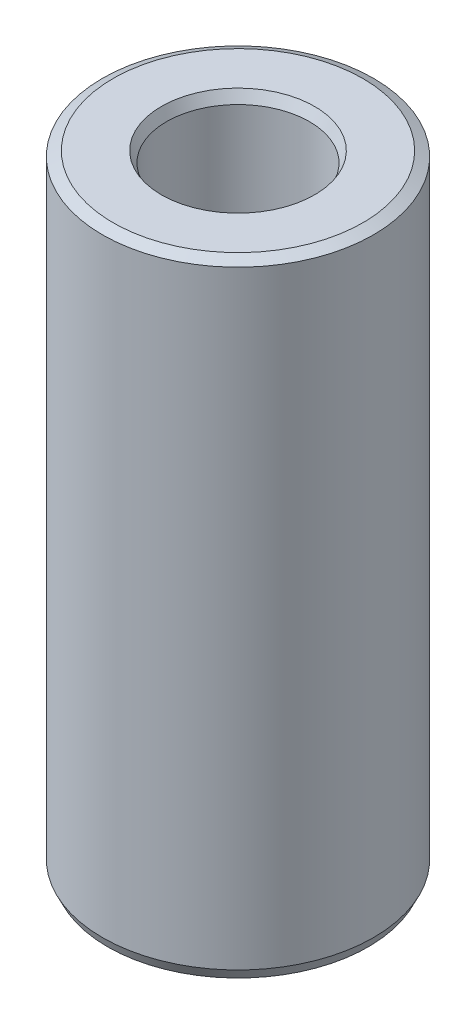
ISO-10303-21;
HEADER;
FILE_DESCRIPTION(('STEP AP214'),'2;1');
FILE_NAME('part.step','',(''),(''),'','','');
FILE_SCHEMA(('AUTOMOTIVE_DESIGN { 1 0 10303 214 1 1 1 1 }'));
ENDSEC;
DATA;
#1=APPLICATION_CONTEXT('core data for automotive mechanical design processes');
#2=APPLICATION_PROTOCOL_DEFINITION('international standard','automotive_design',2000,#1);
#3=PRODUCT_CONTEXT('',#1,'mechanical');
#4=PRODUCT('Part','Part','',(#3));
#5=PRODUCT_RELATED_PRODUCT_CATEGORY('part','',(#4));
#6=PRODUCT_DEFINITION_FORMATION('','',#4);
#7=PRODUCT_DEFINITION_CONTEXT('part definition',#1,'design');
#8=PRODUCT_DEFINITION('design','',#6,#7);
#9=PRODUCT_DEFINITION_SHAPE('','',#8);
#10=(LENGTH_UNIT() NAMED_UNIT(*) SI_UNIT(.MILLI.,.METRE.));
#11=(NAMED_UNIT(*) PLANE_ANGLE_UNIT() SI_UNIT($,.RADIAN.));
#12=(NAMED_UNIT(*) SI_UNIT($,.STERADIAN.) SOLID_ANGLE_UNIT());
#13=UNCERTAINTY_MEASURE_WITH_UNIT(LENGTH_MEASURE(1.E-05),#10,'distance_accuracy_value','');
#14=(GEOMETRIC_REPRESENTATION_CONTEXT(3) GLOBAL_UNCERTAINTY_ASSIGNED_CONTEXT((#13)) GLOBAL_UNIT_ASSIGNED_CONTEXT((#10,
#11,#12)) REPRESENTATION_CONTEXT('',''));
#15=CARTESIAN_POINT('',(0.,0.,0.));
#16=DIRECTION('',(0.,0.,1.));
#17=DIRECTION('',(1.,0.,0.));
#18=AXIS2_PLACEMENT_3D('',#15,#16,#17);
#19=CARTESIAN_POINT('',(0.,230.315111073025,0.));
#20=DIRECTION('',(0.,-1.,0.));
#21=DIRECTION('',(0.,0.,-1.));
#22=AXIS2_PLACEMENT_3D('',#19,#20,#21);
#23=CYLINDRICAL_SURFACE('',#22,50.);
#24=CARTESIAN_POINT('',(0.,3.91410527196218,0.));
#25=DIRECTION('',(0.,1.,0.));
#26=DIRECTION('',(0.,0.,1.));
#27=AXIS2_PLACEMENT_3D('',#24,#25,#26);
#28=CIRCLE('',#27,50.);
#29=CARTESIAN_POINT('',(0.,3.91410527196218,50.));
#30=VERTEX_POINT('',#29);
#31=EDGE_CURVE('E10',#30,#30,#28,.T.);
#32=ORIENTED_EDGE('',*,*,#31,.T.);
#33=EDGE_LOOP('',(#32));
#34=FACE_BOUND('',#33,.T.);
#35=CARTESIAN_POINT('',(0.,228.420016169975,0.));
#36=DIRECTION('',(0.,1.,0.));
#37=DIRECTION('',(0.,0.,1.));
#38=AXIS2_PLACEMENT_3D('',#35,#36,#37);
#39=CIRCLE('',#38,50.);
#40=CARTESIAN_POINT('',(0.,228.420016169975,-50.));
#41=VERTEX_POINT('',#40);
#42=EDGE_CURVE('E50',#41,#41,#39,.F.);
#43=ORIENTED_EDGE('',*,*,#42,.T.);
#44=EDGE_LOOP('',(#43));
#45=FACE_BOUND('',#44,.T.);
#46=ADVANCED_FACE('F39',(#34,#45),#23,.T.);
#47=CARTESIAN_POINT('',(0.,230.315111073025,0.));
#48=DIRECTION('',(0.,1.,0.));
#49=DIRECTION('',(0.,0.,1.));
#50=AXIS2_PLACEMENT_3D('',#47,#48,#49);
#51=PLANE('',#50);
#52=CARTESIAN_POINT('',(0.,230.315111073025,0.));
#53=DIRECTION('',(0.,1.,0.));
#54=DIRECTION('',(0.,0.,1.));
#55=AXIS2_PLACEMENT_3D('',#52,#53,#54);
#56=CIRCLE('',#55,28.2652604303224);
#57=CARTESIAN_POINT('',(0.,230.315111073025,28.2652604303224));
#58=VERTEX_POINT('',#57);
#59=EDGE_CURVE('E58',#58,#58,#56,.F.);
#60=ORIENTED_EDGE('',*,*,#59,.T.);
#61=EDGE_LOOP('',(#60));
#62=FACE_BOUND('',#61,.T.);
#63=CARTESIAN_POINT('',(0.,230.315111073025,0.));
#64=DIRECTION('',(0.,1.,0.));
#65=DIRECTION('',(0.,0.,1.));
#66=AXIS2_PLACEMENT_3D('',#63,#64,#65);
#67=CIRCLE('',#66,46.0858947280378);
#68=CARTESIAN_POINT('',(0.,230.315111073025,-46.0858947280378));
#69=VERTEX_POINT('',#68);
#70=EDGE_CURVE('E61',#69,#69,#67,.T.);
#71=ORIENTED_EDGE('',*,*,#70,.T.);
#72=EDGE_LOOP('',(#71));
#73=FACE_BOUND('',#72,.T.);
#74=ADVANCED_FACE('F88',(#62,#73),#51,.T.);
#75=CARTESIAN_POINT('',(0.,0.,0.));
#76=DIRECTION('',(0.,1.,0.));
#77=DIRECTION('',(0.,0.,1.));
#78=AXIS2_PLACEMENT_3D('',#75,#76,#77);
#79=PLANE('',#78);
#80=CARTESIAN_POINT('',(0.,0.,0.));
#81=DIRECTION('',(0.,1.,0.));
#82=DIRECTION('',(0.,0.,1.));
#83=AXIS2_PLACEMENT_3D('',#80,#81,#82);
#84=CIRCLE('',#83,30.2842707992345);
#85=CARTESIAN_POINT('',(0.,0.,-30.2842707992345));
#86=VERTEX_POINT('',#85);
#87=EDGE_CURVE('E51',#86,#86,#84,.T.);
#88=ORIENTED_EDGE('',*,*,#87,.T.);
#89=EDGE_LOOP('',(#88));
#90=FACE_BOUND('',#89,.T.);
#91=CARTESIAN_POINT('',(0.,0.,0.));
#92=DIRECTION('',(0.,1.,0.));
#93=DIRECTION('',(0.,0.,1.));
#94=AXIS2_PLACEMENT_3D('',#91,#92,#93);
#95=CIRCLE('',#94,48.1049050969498);
#96=CARTESIAN_POINT('',(0.,0.,48.1049050969498));
#97=VERTEX_POINT('',#96);
#98=EDGE_CURVE('E54',#97,#97,#95,.F.);
#99=ORIENTED_EDGE('',*,*,#98,.T.);
#100=EDGE_LOOP('',(#99));
#101=FACE_BOUND('',#100,.T.);
#102=ADVANCED_FACE('F83',(#90,#101),#79,.F.);
#103=CARTESIAN_POINT('',(0.,230.315111073025,0.));
#104=DIRECTION('',(0.,-1.,0.));
#105=DIRECTION('',(0.,0.,-1.));
#106=AXIS2_PLACEMENT_3D('',#103,#104,#105);
#107=CYLINDRICAL_SURFACE('',#106,26.3701655272722);
#108=CARTESIAN_POINT('',(0.,226.401005801063,0.));
#109=DIRECTION('',(0.,1.,0.));
#110=DIRECTION('',(0.,0.,1.));
#111=AXIS2_PLACEMENT_3D('',#108,#109,#110);
#112=CIRCLE('',#111,26.3701655272722);
#113=CARTESIAN_POINT('',(0.,226.401005801063,26.3701655272722));
#114=VERTEX_POINT('',#113);
#115=EDGE_CURVE('E67',#114,#114,#112,.T.);
#116=ORIENTED_EDGE('',*,*,#115,.T.);
#117=EDGE_LOOP('',(#116));
#118=FACE_BOUND('',#117,.T.);
#119=CARTESIAN_POINT('',(0.,1.8950949030502,0.));
#120=DIRECTION('',(0.,1.,0.));
#121=DIRECTION('',(0.,0.,1.));
#122=AXIS2_PLACEMENT_3D('',#119,#120,#121);
#123=CIRCLE('',#122,26.3701655272722);
#124=CARTESIAN_POINT('',(0.,1.8950949030502,-26.3701655272722));
#125=VERTEX_POINT('',#124);
#126=EDGE_CURVE('E69',#125,#125,#123,.F.);
#127=ORIENTED_EDGE('',*,*,#126,.T.);
#128=EDGE_LOOP('',(#127));
#129=FACE_BOUND('',#128,.T.);
#130=ADVANCED_FACE('F71',(#118,#129),#107,.F.);
#131=CARTESIAN_POINT('',(0.,226.401005801063,0.));
#132=DIRECTION('',(0.,1.,0.));
#133=DIRECTION('',(0.,0.,1.));
#134=AXIS2_PLACEMENT_3D('',#131,#132,#133);
#135=CONICAL_SURFACE('',#134,26.3701655272722,0.450904128025095);
#136=ORIENTED_EDGE('',*,*,#59,.F.);
#137=EDGE_LOOP('',(#136));
#138=FACE_BOUND('',#137,.T.);
#139=ORIENTED_EDGE('',*,*,#115,.F.);
#140=EDGE_LOOP('',(#139));
#141=FACE_BOUND('',#140,.T.);
#142=ADVANCED_FACE('F77',(#138,#141),#135,.F.);
#143=CARTESIAN_POINT('',(0.,0.,0.));
#144=DIRECTION('',(0.,-1.,0.));
#145=DIRECTION('',(0.,0.,-1.));
#146=AXIS2_PLACEMENT_3D('',#143,#144,#145);
#147=CONICAL_SURFACE('',#146,30.2842707992345,1.1198921987698);
#148=CARTESIAN_POINT('',(0.,1.8950949030502,-26.3701655272722));
#149=CARTESIAN_POINT('',(0.,1.87535433114343,-26.4109374571885));
#150=CARTESIAN_POINT('',(0.,1.85561375923666,-26.4517093871048));
#151=CARTESIAN_POINT('',(0.,1.81613261542311,-26.5332532469373));
#152=CARTESIAN_POINT('',(0.,1.79639204351634,-26.5740251768536));
#153=CARTESIAN_POINT('',(0.,1.75691089970279,-26.6555690366861));
#154=CARTESIAN_POINT('',(0.,1.73717032779602,-26.6963409666024));
#155=CARTESIAN_POINT('',(0.,1.69768918398247,-26.777884826435));
#156=CARTESIAN_POINT('',(0.,1.6779486120757,-26.8186567563512));
#157=CARTESIAN_POINT('',(0.,1.63846746826216,-26.9002006161838));
#158=CARTESIAN_POINT('',(0.,1.61872689635538,-26.9409725461001));
#159=CARTESIAN_POINT('',(0.,1.57924575254184,-27.0225164059326));
#160=CARTESIAN_POINT('',(0.,1.55950518063506,-27.0632883358489));
#161=CARTESIAN_POINT('',(0.,1.52002403682152,-27.1448321956814));
#162=CARTESIAN_POINT('',(0.,1.50028346491474,-27.1856041255977));
#163=CARTESIAN_POINT('',(0.,1.4608023211012,-27.2671479854302));
#164=CARTESIAN_POINT('',(0.,1.44106174919443,-27.3079199153465));
#165=CARTESIAN_POINT('',(0.,1.40158060538088,-27.3894637751791));
#166=CARTESIAN_POINT('',(0.,1.38184003347411,-27.4302357050953));
#167=CARTESIAN_POINT('',(0.,1.34235888966056,-27.5117795649279));
#168=CARTESIAN_POINT('',(0.,1.32261831775379,-27.5525514948442));
#169=CARTESIAN_POINT('',(0.,1.28313717394024,-27.6340953546767));
#170=CARTESIAN_POINT('',(0.,1.26339660203347,-27.674867284593));
#171=CARTESIAN_POINT('',(0.,1.22391545821992,-27.7564111444255));
#172=CARTESIAN_POINT('',(0.,1.20417488631315,-27.7971830743418));
#173=CARTESIAN_POINT('',(0.,1.1646937424996,-27.8787269341743));
#174=CARTESIAN_POINT('',(0.,1.14495317059283,-27.9194988640906));
#175=CARTESIAN_POINT('',(0.,1.10547202677929,-28.0010427239232));
#176=CARTESIAN_POINT('',(0.,1.08573145487251,-28.0418146538394));
#177=CARTESIAN_POINT('',(0.,1.04625031105897,-28.123358513672));
#178=CARTESIAN_POINT('',(0.,1.02650973915219,-28.1641304435883));
#179=CARTESIAN_POINT('',(0.,0.987028595338648,-28.2456743034208));
#180=CARTESIAN_POINT('',(0.,0.967288023431875,-28.2864462333371));
#181=CARTESIAN_POINT('',(0.,0.927806879618329,-28.3679900931696));
#182=CARTESIAN_POINT('',(0.,0.908066307711556,-28.4087620230859));
#183=CARTESIAN_POINT('',(0.,0.86858516389801,-28.4903058829185));
#184=CARTESIAN_POINT('',(0.,0.848844591991237,-28.5310778128347));
#185=CARTESIAN_POINT('',(0.,0.809363448177691,-28.6126216726673));
#186=CARTESIAN_POINT('',(0.,0.789622876270918,-28.6533936025835));
#187=CARTESIAN_POINT('',(0.,0.750141732457372,-28.7349374624161));
#188=CARTESIAN_POINT('',(0.,0.730401160550599,-28.7757093923324));
#189=CARTESIAN_POINT('',(0.,0.690920016737054,-28.8572532521649));
#190=CARTESIAN_POINT('',(0.,0.671179444830281,-28.8980251820812));
#191=CARTESIAN_POINT('',(0.,0.631698301016734,-28.9795690419137));
#192=CARTESIAN_POINT('',(0.,0.611957729109961,-29.02034097183));
#193=CARTESIAN_POINT('',(0.,0.572476585296416,-29.1018848316626));
#194=CARTESIAN_POINT('',(0.,0.552736013389643,-29.1426567615788));
#195=CARTESIAN_POINT('',(0.,0.513254869576097,-29.2242006214114));
#196=CARTESIAN_POINT('',(0.,0.493514297669324,-29.2649725513276));
#197=CARTESIAN_POINT('',(0.,0.454033153855778,-29.3465164111602));
#198=CARTESIAN_POINT('',(0.,0.434292581949005,-29.3872883410765));
#199=CARTESIAN_POINT('',(0.,0.394811438135459,-29.468832200909));
#200=CARTESIAN_POINT('',(0.,0.375070866228686,-29.5096041308253));
#201=CARTESIAN_POINT('',(0.,0.33558972241514,-29.5911479906578));
#202=CARTESIAN_POINT('',(0.,0.315849150508367,-29.6319199205741));
#203=CARTESIAN_POINT('',(0.,0.276368006694822,-29.7134637804067));
#204=CARTESIAN_POINT('',(0.,0.256627434788049,-29.7542357103229));
#205=CARTESIAN_POINT('',(0.,0.217146290974502,-29.8357795701555));
#206=CARTESIAN_POINT('',(0.,0.19740571906773,-29.8765515000717));
#207=CARTESIAN_POINT('',(0.,0.157924575254184,-29.9580953599043));
#208=CARTESIAN_POINT('',(0.,0.13818400334741,-29.9988672898206));
#209=CARTESIAN_POINT('',(0.,0.0987028595338646,-30.0804111496531));
#210=CARTESIAN_POINT('',(0.,0.0789622876270918,-30.1211830795694));
#211=CARTESIAN_POINT('',(0.,0.0394811438135464,-30.2027269394019));
#212=CARTESIAN_POINT('',(0.,0.0197405719067736,-30.2434988693182));
#213=CARTESIAN_POINT('',(0.,0.,-30.2842707992345));
#214=B_SPLINE_CURVE_WITH_KNOTS('',3,(#148,#149,#150,#151,#152,#153,#154,#155,#156,#157,#158,
#159,#160,#161,#162,#163,#164,#165,#166,#167,#168,#169,#170,#171,#172,#173,#174,#175,#176,#177,
#178,#179,#180,#181,#182,#183,#184,#185,#186,#187,#188,#189,#190,#191,#192,#193,#194,#195,#196,
#197,#198,#199,#200,#201,#202,#203,#204,#205,#206,#207,#208,#209,#210,#211,#212,#213),
.UNSPECIFIED.,.F.,.F.,(4,2,2,2,2,2,2,2,2,2,2,2,2,2,2,2,2,2,2,2,2,2,2,2,2,2,2,2,2,2,2,2,4),(0.,
0.135898359205458,0.27179671841092,0.407695077616378,0.543593436821836,0.679491796027294,
0.815390155232755,0.951288514438214,1.08718687364367,1.22308523284913,1.35898359205459,
1.49488195126005,1.63078031046551,1.76667866967097,1.90257702887643,2.03847538808188,
2.17437374728735,2.3102721064928,2.44617046569826,2.58206882490372,2.71796718410918,
2.85386554331464,2.9897639025201,3.12566226172556,3.26156062093102,3.39745898013647,
3.53335733934193,3.66925569854739,3.80515405775285,3.94105241695831,4.07695077616377,
4.21284913536923,4.34874749457469),.UNSPECIFIED.);
#215=EDGE_CURVE('BSEAM73',#125,#86,#214,.T.);
#216=ORIENTED_EDGE('',*,*,#126,.F.);
#217=ORIENTED_EDGE('',*,*,#87,.F.);
#218=ORIENTED_EDGE('',*,*,#215,.T.);
#219=ORIENTED_EDGE('',*,*,#215,.F.);
#220=EDGE_LOOP('',(#216,#218,#217,#219));
#221=FACE_BOUND('',#220,.T.);
#222=ADVANCED_FACE('F73',(#221),#147,.F.);
#223=CARTESIAN_POINT('',(0.,3.91410527196218,0.));
#224=DIRECTION('',(0.,1.,0.));
#225=DIRECTION('',(0.,0.,1.));
#226=AXIS2_PLACEMENT_3D('',#223,#224,#225);
#227=CONICAL_SURFACE('',#226,50.,0.450904128025099);
#228=ORIENTED_EDGE('',*,*,#98,.F.);
#229=EDGE_LOOP('',(#228));
#230=FACE_BOUND('',#229,.T.);
#231=ORIENTED_EDGE('',*,*,#31,.F.);
#232=EDGE_LOOP('',(#231));
#233=FACE_BOUND('',#232,.T.);
#234=ADVANCED_FACE('F76',(#230,#233),#227,.T.);
#235=CARTESIAN_POINT('',(0.,230.315111073025,0.));
#236=DIRECTION('',(0.,-1.,0.));
#237=DIRECTION('',(0.,0.,-1.));
#238=AXIS2_PLACEMENT_3D('',#235,#236,#237);
#239=CONICAL_SURFACE('',#238,46.0858947280378,1.11989219876981);
#240=CARTESIAN_POINT('',(0.,228.420016169975,-50.));
#241=CARTESIAN_POINT('',(0.,228.439756741882,-49.9592280700838));
#242=CARTESIAN_POINT('',(0.,228.459497313788,-49.9184561401675));
#243=CARTESIAN_POINT('',(0.,228.498978457602,-49.8369122803349));
#244=CARTESIAN_POINT('',(0.,228.518719029509,-49.7961403504187));
#245=CARTESIAN_POINT('',(0.,228.558200173322,-49.7145964905861));
#246=CARTESIAN_POINT('',(0.,228.577940745229,-49.6738245606698));
#247=CARTESIAN_POINT('',(0.,228.617421889043,-49.5922807008373));
#248=CARTESIAN_POINT('',(0.,228.637162460949,-49.551508770921));
#249=CARTESIAN_POINT('',(0.,228.676643604763,-49.4699649110885));
#250=CARTESIAN_POINT('',(0.,228.69638417667,-49.4291929811722));
#251=CARTESIAN_POINT('',(0.,228.735865320483,-49.3476491213397));
#252=CARTESIAN_POINT('',(0.,228.75560589239,-49.3068771914234));
#253=CARTESIAN_POINT('',(0.,228.795087036204,-49.2253333315908));
#254=CARTESIAN_POINT('',(0.,228.81482760811,-49.1845614016746));
#255=CARTESIAN_POINT('',(0.,228.854308751924,-49.103017541842));
#256=CARTESIAN_POINT('',(0.,228.874049323831,-49.0622456119257));
#257=CARTESIAN_POINT('',(0.,228.913530467644,-48.9807017520932));
#258=CARTESIAN_POINT('',(0.,228.933271039551,-48.9399298221769));
#259=CARTESIAN_POINT('',(0.,228.972752183365,-48.8583859623444));
#260=CARTESIAN_POINT('',(0.,228.992492755271,-48.8176140324281));
#261=CARTESIAN_POINT('',(0.,229.031973899085,-48.7360701725956));
#262=CARTESIAN_POINT('',(0.,229.051714470992,-48.6952982426793));
#263=CARTESIAN_POINT('',(0.,229.091195614805,-48.6137543828467));
#264=CARTESIAN_POINT('',(0.,229.110936186712,-48.5729824529305));
#265=CARTESIAN_POINT('',(0.,229.150417330525,-48.4914385930979));
#266=CARTESIAN_POINT('',(0.,229.170157902432,-48.4506666631816));
#267=CARTESIAN_POINT('',(0.,229.209639046246,-48.3691228033491));
#268=CARTESIAN_POINT('',(0.,229.229379618153,-48.3283508734328));
#269=CARTESIAN_POINT('',(0.,229.268860761966,-48.2468070136003));
#270=CARTESIAN_POINT('',(0.,229.288601333873,-48.206035083684));
#271=CARTESIAN_POINT('',(0.,229.328082477686,-48.1244912238515));
#272=CARTESIAN_POINT('',(0.,229.347823049593,-48.0837192939352));
#273=CARTESIAN_POINT('',(0.,229.387304193407,-48.0021754341026));
#274=CARTESIAN_POINT('',(0.,229.407044765314,-47.9614035041864));
#275=CARTESIAN_POINT('',(0.,229.446525909127,-47.8798596443538));
#276=CARTESIAN_POINT('',(0.,229.466266481034,-47.8390877144375));
#277=CARTESIAN_POINT('',(0.,229.505747624847,-47.757543854605));
#278=CARTESIAN_POINT('',(0.,229.525488196754,-47.7167719246887));
#279=CARTESIAN_POINT('',(0.,229.564969340568,-47.6352280648562));
#280=CARTESIAN_POINT('',(0.,229.584709912474,-47.5944561349399));
#281=CARTESIAN_POINT('',(0.,229.624191056288,-47.5129122751074));
#282=CARTESIAN_POINT('',(0.,229.643931628195,-47.4721403451911));
#283=CARTESIAN_POINT('',(0.,229.683412772008,-47.3905964853585));
#284=CARTESIAN_POINT('',(0.,229.703153343915,-47.3498245554423));
#285=CARTESIAN_POINT('',(0.,229.742634487729,-47.2682806956097));
#286=CARTESIAN_POINT('',(0.,229.762375059635,-47.2275087656934));
#287=CARTESIAN_POINT('',(0.,229.801856203449,-47.1459649058609));
#288=CARTESIAN_POINT('',(0.,229.821596775356,-47.1051929759446));
#289=CARTESIAN_POINT('',(0.,229.861077919169,-47.0236491161121));
#290=CARTESIAN_POINT('',(0.,229.880818491076,-46.9828771861958));
#291=CARTESIAN_POINT('',(0.,229.92029963489,-46.9013333263633));
#292=CARTESIAN_POINT('',(0.,229.940040206796,-46.860561396447));
#293=CARTESIAN_POINT('',(0.,229.97952135061,-46.7790175366144));
#294=CARTESIAN_POINT('',(0.,229.999261922517,-46.7382456066982));
#295=CARTESIAN_POINT('',(0.,230.03874306633,-46.6567017468656));
#296=CARTESIAN_POINT('',(0.,230.058483638237,-46.6159298169493));
#297=CARTESIAN_POINT('',(0.,230.097964782051,-46.5343859571168));
#298=CARTESIAN_POINT('',(0.,230.117705353957,-46.4936140272005));
#299=CARTESIAN_POINT('',(0.,230.157186497771,-46.412070167368));
#300=CARTESIAN_POINT('',(0.,230.176927069678,-46.3712982374517));
#301=CARTESIAN_POINT('',(0.,230.216408213491,-46.2897543776192));
#302=CARTESIAN_POINT('',(0.,230.236148785398,-46.2489824477029));
#303=CARTESIAN_POINT('',(0.,230.275629929212,-46.1674385878703));
#304=CARTESIAN_POINT('',(0.,230.295370501118,-46.1266666579541));
#305=CARTESIAN_POINT('',(0.,230.315111073025,-46.0858947280378));
#306=B_SPLINE_CURVE_WITH_KNOTS('',3,(#240,#241,#242,#243,#244,#245,#246,#247,#248,#249,#250,
#251,#252,#253,#254,#255,#256,#257,#258,#259,#260,#261,#262,#263,#264,#265,#266,#267,#268,#269,
#270,#271,#272,#273,#274,#275,#276,#277,#278,#279,#280,#281,#282,#283,#284,#285,#286,#287,#288,
#289,#290,#291,#292,#293,#294,#295,#296,#297,#298,#299,#300,#301,#302,#303,#304,#305),
.UNSPECIFIED.,.F.,.F.,(4,2,2,2,2,2,2,2,2,2,2,2,2,2,2,2,2,2,2,2,2,2,2,2,2,2,2,2,2,2,2,2,4),(0.,
0.135898359205468,0.271796718410925,0.407695077616381,0.543593436821837,0.679491796027293,
0.81539015523275,0.951288514438206,1.08718687364366,1.22308523284912,1.35898359205457,
1.49488195126004,1.63078031046551,1.76667866967096,1.90257702887642,2.03847538808187,
2.17437374728733,2.31027210649279,2.44617046569824,2.5820688249037,2.71796718410916,
2.85386554331461,2.98976390252008,3.12566226172554,3.26156062093099,3.39745898013645,
3.53335733934191,3.66925569854737,3.80515405775283,3.94105241695828,4.07695077616374,
4.21284913536919,4.34874749457466),.UNSPECIFIED.);
#307=EDGE_CURVE('BSEAM45',#41,#69,#306,.T.);
#308=ORIENTED_EDGE('',*,*,#42,.F.);
#309=ORIENTED_EDGE('',*,*,#70,.F.);
#310=ORIENTED_EDGE('',*,*,#307,.T.);
#311=ORIENTED_EDGE('',*,*,#307,.F.);
#312=EDGE_LOOP('',(#308,#310,#309,#311));
#313=FACE_BOUND('',#312,.T.);
#314=ADVANCED_FACE('F45',(#313),#239,.T.);
#315=CLOSED_SHELL('',(#46,#74,#102,#130,#142,#222,#234,#314));
#316=MANIFOLD_SOLID_BREP('B2',#315);
#317=ADVANCED_BREP_SHAPE_REPRESENTATION('',(#18,#316),#14);
#318=SHAPE_DEFINITION_REPRESENTATION(#9,#317);
ENDSEC;
END-ISO-10303-21;
